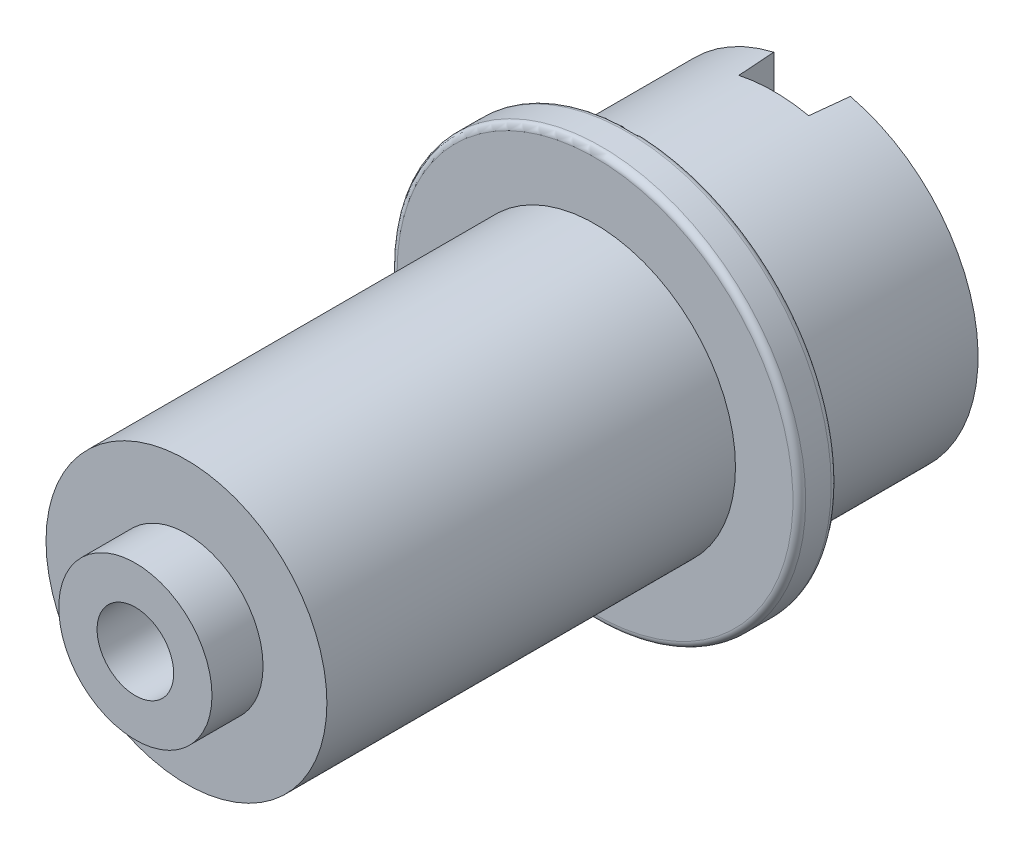
ISO-10303-21;
HEADER;
FILE_DESCRIPTION(('STEP AP214'),'2;1');
FILE_NAME('part.step','',(''),(''),'','','');
FILE_SCHEMA(('AUTOMOTIVE_DESIGN { 1 0 10303 214 1 1 1 1 }'));
ENDSEC;
DATA;
#1=APPLICATION_CONTEXT('core data for automotive mechanical design processes');
#2=APPLICATION_PROTOCOL_DEFINITION('international standard','automotive_design',2000,#1);
#3=PRODUCT_CONTEXT('',#1,'mechanical');
#4=PRODUCT('Part','Part','',(#3));
#5=PRODUCT_RELATED_PRODUCT_CATEGORY('part','',(#4));
#6=PRODUCT_DEFINITION_FORMATION('','',#4);
#7=PRODUCT_DEFINITION_CONTEXT('part definition',#1,'design');
#8=PRODUCT_DEFINITION('design','',#6,#7);
#9=PRODUCT_DEFINITION_SHAPE('','',#8);
#10=(LENGTH_UNIT() NAMED_UNIT(*) SI_UNIT(.MILLI.,.METRE.));
#11=(NAMED_UNIT(*) PLANE_ANGLE_UNIT() SI_UNIT($,.RADIAN.));
#12=(NAMED_UNIT(*) SI_UNIT($,.STERADIAN.) SOLID_ANGLE_UNIT());
#13=UNCERTAINTY_MEASURE_WITH_UNIT(LENGTH_MEASURE(1.E-05),#10,'distance_accuracy_value','');
#14=(GEOMETRIC_REPRESENTATION_CONTEXT(3) GLOBAL_UNCERTAINTY_ASSIGNED_CONTEXT((#13)) GLOBAL_UNIT_ASSIGNED_CONTEXT((#10,
#11,#12)) REPRESENTATION_CONTEXT('',''));
#15=CARTESIAN_POINT('',(0.,0.,0.));
#16=DIRECTION('',(0.,0.,1.));
#17=DIRECTION('',(1.,0.,0.));
#18=AXIS2_PLACEMENT_3D('',#15,#16,#17);
#19=CARTESIAN_POINT('',(0.,0.,-1.5));
#20=DIRECTION('',(0.,0.,-1.));
#21=DIRECTION('',(-1.,0.,0.));
#22=AXIS2_PLACEMENT_3D('',#19,#20,#21);
#23=PLANE('',#22);
#24=CARTESIAN_POINT('',(0.,0.,-1.5));
#25=DIRECTION('',(0.,0.,-1.));
#26=DIRECTION('',(-1.,0.,0.));
#27=AXIS2_PLACEMENT_3D('',#24,#25,#26);
#28=CIRCLE('',#27,7.75);
#29=CARTESIAN_POINT('',(-7.75,0.,-1.5));
#30=VERTEX_POINT('',#29);
#31=EDGE_CURVE('E280',#30,#30,#28,.T.);
#32=ORIENTED_EDGE('',*,*,#31,.T.);
#33=EDGE_LOOP('',(#32));
#34=FACE_BOUND('',#33,.T.);
#35=DIRECTION('',(0.,1.,0.));
#36=VECTOR('',#35,1.);
#37=CARTESIAN_POINT('',(3.,-7.,-1.50000000000001));
#38=LINE('',#37,#36);
#39=CARTESIAN_POINT('',(3.,-7.,-1.50000000000001));
#40=VERTEX_POINT('',#39);
#41=CARTESIAN_POINT('',(3.,-5.7662812973354,-1.50000000000001));
#42=VERTEX_POINT('',#41);
#43=EDGE_CURVE('E128',#40,#42,#38,.T.);
#44=ORIENTED_EDGE('',*,*,#43,.T.);
#45=CARTESIAN_POINT('',(0.,0.,-1.5));
#46=DIRECTION('',(0.,0.,-1.));
#47=DIRECTION('',(-1.,0.,0.));
#48=AXIS2_PLACEMENT_3D('',#45,#46,#47);
#49=CIRCLE('',#48,6.5);
#50=CARTESIAN_POINT('',(-3.,-5.7662812973354,-1.5));
#51=VERTEX_POINT('',#50);
#52=EDGE_CURVE('E154',#51,#42,#49,.T.);
#53=ORIENTED_EDGE('',*,*,#52,.F.);
#54=DIRECTION('',(0.,1.,0.));
#55=VECTOR('',#54,1.);
#56=CARTESIAN_POINT('',(-3.,-7.,-1.49999999999997));
#57=LINE('',#56,#55);
#58=CARTESIAN_POINT('',(-3.,-7.,-1.49999999999997));
#59=VERTEX_POINT('',#58);
#60=EDGE_CURVE('E46',#59,#51,#57,.T.);
#61=ORIENTED_EDGE('',*,*,#60,.F.);
#62=DIRECTION('',(1.,0.,0.));
#63=VECTOR('',#62,1.);
#64=CARTESIAN_POINT('',(-3.,-7.,-1.49999999999997));
#65=LINE('',#64,#63);
#66=EDGE_CURVE('E112',#59,#40,#65,.T.);
#67=ORIENTED_EDGE('',*,*,#66,.T.);
#68=EDGE_LOOP('',(#44,#53,#61,#67));
#69=FACE_BOUND('',#68,.T.);
#70=ADVANCED_FACE('F31',(#34,#69),#23,.T.);
#71=CARTESIAN_POINT('',(0.,0.,16.));
#72=DIRECTION('',(0.,0.,1.));
#73=DIRECTION('',(1.,0.,0.));
#74=AXIS2_PLACEMENT_3D('',#71,#72,#73);
#75=PLANE('',#74);
#76=CARTESIAN_POINT('',(0.,0.,16.));
#77=DIRECTION('',(0.,0.,1.));
#78=DIRECTION('',(1.,0.,0.));
#79=AXIS2_PLACEMENT_3D('',#76,#77,#78);
#80=CIRCLE('',#79,5.5);
#81=CARTESIAN_POINT('',(5.5,0.,16.));
#82=VERTEX_POINT('',#81);
#83=EDGE_CURVE('E169',#82,#82,#80,.T.);
#84=ORIENTED_EDGE('',*,*,#83,.T.);
#85=EDGE_LOOP('',(#84));
#86=FACE_BOUND('',#85,.T.);
#87=CARTESIAN_POINT('',(0.,0.,16.));
#88=DIRECTION('',(0.,0.,1.));
#89=DIRECTION('',(1.,0.,0.));
#90=AXIS2_PLACEMENT_3D('',#87,#88,#89);
#91=CIRCLE('',#90,3.);
#92=CARTESIAN_POINT('',(3.,0.,16.));
#93=VERTEX_POINT('',#92);
#94=EDGE_CURVE('E163',#93,#93,#91,.T.);
#95=ORIENTED_EDGE('',*,*,#94,.F.);
#96=EDGE_LOOP('',(#95));
#97=FACE_BOUND('',#96,.T.);
#98=ADVANCED_FACE('F229',(#86,#97),#75,.T.);
#99=CARTESIAN_POINT('',(0.,0.,16.));
#100=DIRECTION('',(0.,0.,-1.));
#101=DIRECTION('',(-1.,0.,0.));
#102=AXIS2_PLACEMENT_3D('',#99,#100,#101);
#103=CYLINDRICAL_SURFACE('',#102,5.5);
#104=ORIENTED_EDGE('',*,*,#83,.F.);
#105=EDGE_LOOP('',(#104));
#106=FACE_BOUND('',#105,.T.);
#107=CARTESIAN_POINT('',(0.,0.,0.));
#108=DIRECTION('',(0.,0.,-1.));
#109=DIRECTION('',(-1.,0.,0.));
#110=AXIS2_PLACEMENT_3D('',#107,#108,#109);
#111=CIRCLE('',#110,5.5);
#112=CARTESIAN_POINT('',(-5.5,0.,0.));
#113=VERTEX_POINT('',#112);
#114=EDGE_CURVE('E160',#113,#113,#111,.T.);
#115=ORIENTED_EDGE('',*,*,#114,.F.);
#116=EDGE_LOOP('',(#115));
#117=FACE_BOUND('',#116,.T.);
#118=ADVANCED_FACE('F33',(#106,#117),#103,.T.);
#119=CARTESIAN_POINT('',(0.,0.,18.));
#120=DIRECTION('',(0.,0.,-1.));
#121=DIRECTION('',(-1.,0.,0.));
#122=AXIS2_PLACEMENT_3D('',#119,#120,#121);
#123=CYLINDRICAL_SURFACE('',#122,3.);
#124=CARTESIAN_POINT('',(0.,0.,18.));
#125=DIRECTION('',(0.,0.,1.));
#126=DIRECTION('',(1.,0.,0.));
#127=AXIS2_PLACEMENT_3D('',#124,#125,#126);
#128=CIRCLE('',#127,3.);
#129=CARTESIAN_POINT('',(3.,0.,18.));
#130=VERTEX_POINT('',#129);
#131=EDGE_CURVE('E166',#130,#130,#128,.T.);
#132=ORIENTED_EDGE('',*,*,#131,.F.);
#133=EDGE_LOOP('',(#132));
#134=FACE_BOUND('',#133,.T.);
#135=ORIENTED_EDGE('',*,*,#94,.T.);
#136=EDGE_LOOP('',(#135));
#137=FACE_BOUND('',#136,.T.);
#138=ADVANCED_FACE('F246',(#134,#137),#123,.T.);
#139=CARTESIAN_POINT('',(0.,0.,18.));
#140=DIRECTION('',(0.,0.,1.));
#141=DIRECTION('',(1.,0.,0.));
#142=AXIS2_PLACEMENT_3D('',#139,#140,#141);
#143=PLANE('',#142);
#144=CARTESIAN_POINT('',(0.,0.,18.));
#145=DIRECTION('',(0.,0.,1.));
#146=DIRECTION('',(1.,0.,0.));
#147=AXIS2_PLACEMENT_3D('',#144,#145,#146);
#148=CIRCLE('',#147,1.5);
#149=CARTESIAN_POINT('',(1.5,0.,18.));
#150=VERTEX_POINT('',#149);
#151=EDGE_CURVE('E286',#150,#150,#148,.T.);
#152=ORIENTED_EDGE('',*,*,#151,.F.);
#153=EDGE_LOOP('',(#152));
#154=FACE_BOUND('',#153,.T.);
#155=ORIENTED_EDGE('',*,*,#131,.T.);
#156=EDGE_LOOP('',(#155));
#157=FACE_BOUND('',#156,.T.);
#158=ADVANCED_FACE('F243',(#154,#157),#143,.T.);
#159=CARTESIAN_POINT('',(0.,0.,0.));
#160=DIRECTION('',(0.,0.,-1.));
#161=DIRECTION('',(-1.,0.,0.));
#162=AXIS2_PLACEMENT_3D('',#159,#160,#161);
#163=PLANE('',#162);
#164=CARTESIAN_POINT('',(0.,0.,0.));
#165=DIRECTION('',(0.,0.,-1.));
#166=DIRECTION('',(-1.,0.,0.));
#167=AXIS2_PLACEMENT_3D('',#164,#165,#166);
#168=CIRCLE('',#167,7.75);
#169=CARTESIAN_POINT('',(-7.75,0.,0.));
#170=VERTEX_POINT('',#169);
#171=EDGE_CURVE('E11',#170,#170,#168,.F.);
#172=ORIENTED_EDGE('',*,*,#171,.T.);
#173=EDGE_LOOP('',(#172));
#174=FACE_BOUND('',#173,.T.);
#175=ORIENTED_EDGE('',*,*,#114,.T.);
#176=EDGE_LOOP('',(#175));
#177=FACE_BOUND('',#176,.T.);
#178=ADVANCED_FACE('F239',(#174,#177),#163,.F.);
#179=CARTESIAN_POINT('',(0.,0.,-1.5));
#180=DIRECTION('',(0.,0.,1.));
#181=DIRECTION('',(1.,0.,0.));
#182=AXIS2_PLACEMENT_3D('',#179,#180,#181);
#183=CYLINDRICAL_SURFACE('',#182,8.);
#184=CARTESIAN_POINT('',(0.,0.,-1.25));
#185=DIRECTION('',(0.,0.,-1.));
#186=DIRECTION('',(-1.,0.,0.));
#187=AXIS2_PLACEMENT_3D('',#184,#185,#186);
#188=CIRCLE('',#187,8.);
#189=CARTESIAN_POINT('',(-8.,0.,-1.25));
#190=VERTEX_POINT('',#189);
#191=EDGE_CURVE('E39',#190,#190,#188,.F.);
#192=ORIENTED_EDGE('',*,*,#191,.T.);
#193=EDGE_LOOP('',(#192));
#194=FACE_BOUND('',#193,.T.);
#195=CARTESIAN_POINT('',(0.,0.,-0.25));
#196=DIRECTION('',(0.,0.,-1.));
#197=DIRECTION('',(-1.,0.,0.));
#198=AXIS2_PLACEMENT_3D('',#195,#196,#197);
#199=CIRCLE('',#198,8.);
#200=CARTESIAN_POINT('',(-8.,0.,-0.25));
#201=VERTEX_POINT('',#200);
#202=EDGE_CURVE('E278',#201,#201,#199,.T.);
#203=ORIENTED_EDGE('',*,*,#202,.T.);
#204=EDGE_LOOP('',(#203));
#205=FACE_BOUND('',#204,.T.);
#206=ADVANCED_FACE('F225',(#194,#205),#183,.T.);
#207=CARTESIAN_POINT('',(0.,0.,-8.5));
#208=DIRECTION('',(0.,0.,1.));
#209=DIRECTION('',(1.,0.,0.));
#210=AXIS2_PLACEMENT_3D('',#207,#208,#209);
#211=CYLINDRICAL_SURFACE('',#210,6.5);
#212=CARTESIAN_POINT('',(0.,0.,-7.));
#213=DIRECTION('',(0.,0.,1.));
#214=DIRECTION('',(1.,0.,0.));
#215=AXIS2_PLACEMENT_3D('',#212,#213,#214);
#216=CIRCLE('',#215,6.5);
#217=CARTESIAN_POINT('',(1.36876700471111,6.35424872717571,-7.));
#218=VERTEX_POINT('',#217);
#219=CARTESIAN_POINT('',(-1.36876700471111,6.35424872717571,-7.));
#220=VERTEX_POINT('',#219);
#221=EDGE_CURVE('E138',#218,#220,#216,.T.);
#222=ORIENTED_EDGE('',*,*,#221,.T.);
#223=CARTESIAN_POINT('',(0.,0.,8.64507845414196));
#224=DIRECTION('',(-0.996194698091746,0.,0.0871557427476584));
#225=DIRECTION('',(0.0871557427476584,0.,0.996194698091746));
#226=AXIS2_PLACEMENT_3D('',#223,#224,#225);
#227=ELLIPSE('',#226,74.5791360968539,6.5);
#228=CARTESIAN_POINT('',(-1.5,6.32455532033676,-8.5));
#229=VERTEX_POINT('',#228);
#230=EDGE_CURVE('E145',#220,#229,#227,.T.);
#231=ORIENTED_EDGE('',*,*,#230,.T.);
#232=CARTESIAN_POINT('',(0.,0.,-8.5));
#233=DIRECTION('',(0.,0.,-1.));
#234=DIRECTION('',(-1.,0.,0.));
#235=AXIS2_PLACEMENT_3D('',#232,#233,#234);
#236=CIRCLE('',#235,6.5);
#237=CARTESIAN_POINT('',(1.5,6.32455532033676,-8.5));
#238=VERTEX_POINT('',#237);
#239=EDGE_CURVE('E157',#238,#229,#236,.T.);
#240=ORIENTED_EDGE('',*,*,#239,.F.);
#241=CARTESIAN_POINT('',(0.,0.,8.64507845414196));
#242=DIRECTION('',(0.996194698091746,0.,0.0871557427476584));
#243=DIRECTION('',(-0.0871557427476584,0.,0.996194698091746));
#244=AXIS2_PLACEMENT_3D('',#241,#242,#243);
#245=ELLIPSE('',#244,74.5791360968539,6.5);
#246=EDGE_CURVE('E142',#238,#218,#245,.T.);
#247=ORIENTED_EDGE('',*,*,#246,.T.);
#248=EDGE_LOOP('',(#222,#231,#240,#247));
#249=FACE_BOUND('',#248,.T.);
#250=ORIENTED_EDGE('',*,*,#52,.T.);
#251=DIRECTION('',(0.,0.,1.));
#252=VECTOR('',#251,1.);
#253=CARTESIAN_POINT('',(3.,-5.7662812973354,-8.5));
#254=LINE('',#253,#252);
#255=CARTESIAN_POINT('',(3.,-5.7662812973354,-5.));
#256=VERTEX_POINT('',#255);
#257=EDGE_CURVE('E189',#42,#256,#254,.F.);
#258=ORIENTED_EDGE('',*,*,#257,.T.);
#259=CARTESIAN_POINT('',(3.,-5.7662812973354,-5.));
#260=CARTESIAN_POINT('',(3.00001325486749,-5.76626092125269,-5.07945393159843));
#261=CARTESIAN_POINT('',(2.9968439571685,-5.76792298613654,-5.15889667416636));
#262=CARTESIAN_POINT('',(2.98424426186683,-5.77445907624308,-5.31711145525811));
#263=CARTESIAN_POINT('',(2.97481707717535,-5.77933145322453,-5.39588381695874));
#264=CARTESIAN_POINT('',(2.94986780093595,-5.79210360094206,-5.55180242470729));
#265=CARTESIAN_POINT('',(2.93437634706702,-5.79998814895088,-5.62895482218778));
#266=CARTESIAN_POINT('',(2.89749007538821,-5.81850289077183,-5.78148270996379));
#267=CARTESIAN_POINT('',(2.8760947185088,-5.82913333529874,-5.85685803731731));
#268=CARTESIAN_POINT('',(2.80344872672043,-5.86460568069906,-6.07932099731613));
#269=CARTESIAN_POINT('',(2.7436725380155,-5.89306438821246,-6.22314808725836));
#270=CARTESIAN_POINT('',(2.60337128590596,-5.95637113726352,-6.49882225419634));
#271=CARTESIAN_POINT('',(2.52281912744835,-5.99122750508405,-6.63065338058671));
#272=CARTESIAN_POINT('',(2.33672447658037,-6.06633769718149,-6.88857183246516));
#273=CARTESIAN_POINT('',(2.22983981013203,-6.10679805162524,-7.01363285633832));
#274=CARTESIAN_POINT('',(1.99693926734487,-6.18687262182293,-7.24481036127222));
#275=CARTESIAN_POINT('',(1.87091876760921,-6.22648663044616,-7.35092225052552));
#276=CARTESIAN_POINT('',(1.59474472210823,-6.30304778899414,-7.54696071087403));
#277=CARTESIAN_POINT('',(1.44364024712299,-6.33972510221638,-7.63566291765493));
#278=CARTESIAN_POINT('',(1.12664825760663,-6.40365031730568,-7.78592513838278));
#279=CARTESIAN_POINT('',(0.960768773700223,-6.43090330269763,-7.84749978998225));
#280=CARTESIAN_POINT('',(0.629868706698132,-6.47142154982129,-7.93782592174846));
#281=CARTESIAN_POINT('',(0.465435750010198,-6.48545102930012,-7.96837987550274));
#282=CARTESIAN_POINT('',(0.133218337060345,-6.50075755264512,-8.0016798660061));
#283=CARTESIAN_POINT('',(-0.0345644432411095,-6.50204082096515,-8.00443947578696));
#284=CARTESIAN_POINT('',(-0.3553847170163,-6.49211498981173,-7.98288790851684));
#285=CARTESIAN_POINT('',(-0.508590859602237,-6.4818278122866,-7.96057464080085));
#286=CARTESIAN_POINT('',(-0.808793598665934,-6.45124986441835,-7.89301384747723));
#287=CARTESIAN_POINT('',(-0.955789851467938,-6.43095854119823,-7.84776505433874));
#288=CARTESIAN_POINT('',(-1.2421119656785,-6.38189566611913,-7.7351762171615));
#289=CARTESIAN_POINT('',(-1.38128946935679,-6.35300132804897,-7.66751459462998));
#290=CARTESIAN_POINT('',(-1.64667796870997,-6.28944357871966,-7.5123901547607));
#291=CARTESIAN_POINT('',(-1.77288397909838,-6.25477796271627,-7.4249197654573));
#292=CARTESIAN_POINT('',(-2.01997062915893,-6.17962435860474,-7.22421081011658));
#293=CARTESIAN_POINT('',(-2.13952681604742,-6.1388918999639,-7.10943053249346));
#294=CARTESIAN_POINT('',(-2.35835109760829,-6.05820178290307,-6.86160136547798));
#295=CARTESIAN_POINT('',(-2.45760519646737,-6.01824467605489,-6.72853997842289));
#296=CARTESIAN_POINT('',(-2.63764698098138,-5.94162278727149,-6.43981323195344));
#297=CARTESIAN_POINT('',(-2.71730972441238,-5.9052106138375,-6.28336600935372));
#298=CARTESIAN_POINT('',(-2.81569663066613,-5.85859720027945,-6.0390280319213));
#299=CARTESIAN_POINT('',(-2.84496710352513,-5.84439750991949,-5.95600505573651));
#300=CARTESIAN_POINT('',(-2.8961975756877,-5.81917947714126,-5.78727579755948));
#301=CARTESIAN_POINT('',(-2.91816079680302,-5.80815973295046,-5.70157071640827));
#302=CARTESIAN_POINT('',(-2.95738281240241,-5.78830560214407,-5.51423534552411));
#303=CARTESIAN_POINT('',(-2.97332046079695,-5.78010598651373,-5.41225714731425));
#304=CARTESIAN_POINT('',(-2.99465167662971,-5.76906317974113,-5.20686210264438));
#305=CARTESIAN_POINT('',(-3.00003902923056,-5.76622314579055,-5.10344444434316));
#306=CARTESIAN_POINT('',(-3.,-5.7662812973354,-5.));
#307=B_SPLINE_CURVE_WITH_KNOTS('',3,(#259,#260,#261,#262,#263,#264,#265,#266,#267,#268,#269,
#270,#271,#272,#273,#274,#275,#276,#277,#278,#279,#280,#281,#282,#283,#284,#285,#286,#287,#288,
#289,#290,#291,#292,#293,#294,#295,#296,#297,#298,#299,#300,#301,#302,#303,#304,#305,#306),
.UNSPECIFIED.,.F.,.F.,(4,2,2,2,2,2,2,2,2,2,2,2,2,2,2,2,2,2,2,2,2,2,2,4),(0.,0.23826278553123,
0.476403337198864,0.713355977077896,0.950330259629165,1.42306618576011,1.89642177724908,
2.40248498359661,2.90867065468407,3.44293565486749,3.97691201893037,4.47769426022451,
4.97823193870282,5.44154616888585,5.90488600690272,6.37518467403007,6.84566341871178,
7.35542436700875,7.86553555764459,8.40031176228758,8.66749187492018,8.93455402961881,
9.24448664723275,9.55460178125648),.UNSPECIFIED.);
#308=CARTESIAN_POINT('',(-3.,-5.7662812973354,-5.));
#309=VERTEX_POINT('',#308);
#310=EDGE_CURVE('E182',#256,#309,#307,.T.);
#311=ORIENTED_EDGE('',*,*,#310,.T.);
#312=DIRECTION('',(0.,0.,1.));
#313=VECTOR('',#312,1.);
#314=CARTESIAN_POINT('',(-3.,-5.7662812973354,-8.5));
#315=LINE('',#314,#313);
#316=EDGE_CURVE('E99',#309,#51,#315,.T.);
#317=ORIENTED_EDGE('',*,*,#316,.T.);
#318=EDGE_LOOP('',(#250,#258,#311,#317));
#319=FACE_BOUND('',#318,.T.);
#320=ADVANCED_FACE('F191',(#249,#319),#211,.T.);
#321=CARTESIAN_POINT('',(0.,0.,-8.5));
#322=DIRECTION('',(0.,0.,-1.));
#323=DIRECTION('',(-1.,0.,0.));
#324=AXIS2_PLACEMENT_3D('',#321,#322,#323);
#325=PLANE('',#324);
#326=DIRECTION('',(0.,1.,0.));
#327=VECTOR('',#326,1.);
#328=CARTESIAN_POINT('',(-1.5,7.,-8.5));
#329=LINE('',#328,#327);
#330=CARTESIAN_POINT('',(-1.5,4.24264068711928,-8.5));
#331=VERTEX_POINT('',#330);
#332=EDGE_CURVE('E133',#331,#229,#329,.T.);
#333=ORIENTED_EDGE('',*,*,#332,.F.);
#334=CARTESIAN_POINT('',(0.,0.,-8.5));
#335=DIRECTION('',(0.,0.,-1.));
#336=DIRECTION('',(-1.,0.,0.));
#337=AXIS2_PLACEMENT_3D('',#334,#335,#336);
#338=CIRCLE('',#337,4.5);
#339=CARTESIAN_POINT('',(1.5,4.24264068711928,-8.5));
#340=VERTEX_POINT('',#339);
#341=EDGE_CURVE('E148',#340,#331,#338,.T.);
#342=ORIENTED_EDGE('',*,*,#341,.F.);
#343=DIRECTION('',(0.,-1.,0.));
#344=VECTOR('',#343,1.);
#345=CARTESIAN_POINT('',(1.5,7.,-8.5));
#346=LINE('',#345,#344);
#347=EDGE_CURVE('E127',#238,#340,#346,.T.);
#348=ORIENTED_EDGE('',*,*,#347,.F.);
#349=ORIENTED_EDGE('',*,*,#239,.T.);
#350=EDGE_LOOP('',(#333,#342,#348,#349));
#351=FACE_BOUND('',#350,.T.);
#352=ADVANCED_FACE('F218',(#351),#325,.T.);
#353=CARTESIAN_POINT('',(0.,0.,10.5));
#354=DIRECTION('',(0.,0.,-1.));
#355=DIRECTION('',(-1.,0.,0.));
#356=AXIS2_PLACEMENT_3D('',#353,#354,#355);
#357=CYLINDRICAL_SURFACE('',#356,4.5);
#358=CARTESIAN_POINT('',(0.,-4.5,-6.5));
#359=CARTESIAN_POINT('',(-0.0818450443300857,-4.50000022951416,-6.50000038059746));
#360=CARTESIAN_POINT('',(-0.163687791807826,-4.49774654261317,-6.49327960080918));
#361=CARTESIAN_POINT('',(-0.324962641309459,-4.48897815304921,-6.46665633677417));
#362=CARTESIAN_POINT('',(-0.404394492178227,-4.48246300803229,-6.44675248407662));
#363=CARTESIAN_POINT('',(-0.558499184252665,-4.46587961859664,-6.39452113492393));
#364=CARTESIAN_POINT('',(-0.633179738829052,-4.4558173159628,-6.36221440631109));
#365=CARTESIAN_POINT('',(-0.776062405207988,-4.43316668576013,-6.28618824074248));
#366=CARTESIAN_POINT('',(-0.844263235438059,-4.42057786001667,-6.2424665524961));
#367=CARTESIAN_POINT('',(-0.9746125125334,-4.39371141664507,-6.14326129271187));
#368=CARTESIAN_POINT('',(-1.03650555044746,-4.37939334695677,-6.08745314860926));
#369=CARTESIAN_POINT('',(-1.15024903905313,-4.35090472174682,-5.96634926794015));
#370=CARTESIAN_POINT('',(-1.20209727823419,-4.33673419935823,-5.90105144760723));
#371=CARTESIAN_POINT('',(-1.29573741334179,-4.30969998715911,-5.76052232720531));
#372=CARTESIAN_POINT('',(-1.33719728733155,-4.29688558913532,-5.68505939040182));
#373=CARTESIAN_POINT('',(-1.40672831081658,-4.27462958127902,-5.52773585831218));
#374=CARTESIAN_POINT('',(-1.43480354608015,-4.26518694241118,-5.44587722425589));
#375=CARTESIAN_POINT('',(-1.47581019226375,-4.25116954904066,-5.28099016775494));
#376=CARTESIAN_POINT('',(-1.48922017240766,-4.24644143654417,-5.19809418726641));
#377=CARTESIAN_POINT('',(-1.50201168500172,-4.24193484944261,-5.03110436876618));
#378=CARTESIAN_POINT('',(-1.50139755240708,-4.24215484534095,-4.94701090893622));
#379=CARTESIAN_POINT('',(-1.48652985555513,-4.2473852251227,-4.78409505433397));
#380=CARTESIAN_POINT('',(-1.47290086975049,-4.25217623801299,-4.70520739562147));
#381=CARTESIAN_POINT('',(-1.43340924427413,-4.26564986586826,-4.55090987058975));
#382=CARTESIAN_POINT('',(-1.40754513988781,-4.27433294676161,-4.4755004218474));
#383=CARTESIAN_POINT('',(-1.34390858709032,-4.29476866696873,-4.32888087561278));
#384=CARTESIAN_POINT('',(-1.30595107306089,-4.30656848689676,-4.25775796179571));
#385=CARTESIAN_POINT('',(-1.21933365945471,-4.33188837863589,-4.12269363758041));
#386=CARTESIAN_POINT('',(-1.17067066854601,-4.34540894685695,-4.05875430959993));
#387=CARTESIAN_POINT('',(-1.06102399902336,-4.37350993751611,-3.93636260275884));
#388=CARTESIAN_POINT('',(-0.999529725114468,-4.38810884032264,-3.8783709582364));
#389=CARTESIAN_POINT('',(-0.867509354955097,-4.41610407580555,-3.7734031000049));
#390=CARTESIAN_POINT('',(-0.796982393491223,-4.42950029307101,-3.72642794275326));
#391=CARTESIAN_POINT('',(-0.647921419569402,-4.4537566190669,-3.6444555496474));
#392=CARTESIAN_POINT('',(-0.569314914624506,-4.46459025012059,-3.6095817629889));
#393=CARTESIAN_POINT('',(-0.406903625046762,-4.48230850716652,-3.55369523906643));
#394=CARTESIAN_POINT('',(-0.323100657232431,-4.48919450482319,-3.53267768686484));
#395=CARTESIAN_POINT('',(-0.156575744293957,-4.49801440607161,-3.50591650096646));
#396=CARTESIAN_POINT('',(-0.0739643997972705,-4.50015002750592,-3.49955028624087));
#397=CARTESIAN_POINT('',(0.0911626049403549,-4.49983354042241,-3.5004990103977));
#398=CARTESIAN_POINT('',(0.173678278979475,-4.49738220629043,-3.50781163996982));
#399=CARTESIAN_POINT('',(0.333779799456382,-4.48830037075656,-3.53541786160394));
#400=CARTESIAN_POINT('',(0.411439210252264,-4.48179298066788,-3.55532930907424));
#401=CARTESIAN_POINT('',(0.562283937869359,-4.46537770245105,-3.60709016670009));
#402=CARTESIAN_POINT('',(0.635468682762909,-4.45546938070013,-3.63894109920168));
#403=CARTESIAN_POINT('',(0.777432444589909,-4.43293396930935,-3.71460564776118));
#404=CARTESIAN_POINT('',(0.84604493882572,-4.42024222133679,-3.75871188992476));
#405=CARTESIAN_POINT('',(0.975097245203379,-4.39357880874394,-3.85729122502023));
#406=CARTESIAN_POINT('',(1.03553455169336,-4.37960675390741,-3.91176748404765));
#407=CARTESIAN_POINT('',(1.14937876170945,-4.35115271970667,-4.03246812650988));
#408=CARTESIAN_POINT('',(1.20234145386866,-4.33667641631142,-4.09911384039029));
#409=CARTESIAN_POINT('',(1.29638628348536,-4.30949959942063,-4.24065735171633));
#410=CARTESIAN_POINT('',(1.33746832189652,-4.29679910073003,-4.31555521795111));
#411=CARTESIAN_POINT('',(1.40639539562454,-4.27473587687075,-4.47150952293484));
#412=CARTESIAN_POINT('',(1.43426719824753,-4.26536641189468,-4.55255311875315));
#413=CARTESIAN_POINT('',(1.47584200013903,-4.25116248459674,-4.7185679750662));
#414=CARTESIAN_POINT('',(1.48955138243091,-4.24632597935459,-4.80353744810652));
#415=CARTESIAN_POINT('',(1.50191442371601,-4.24196788311266,-4.97029564406138));
#416=CARTESIAN_POINT('',(1.5013053859626,-4.24218600386123,-5.05202351043024));
#417=CARTESIAN_POINT('',(1.48686344017304,-4.24726904735801,-5.21414761238309));
#418=CARTESIAN_POINT('',(1.47303131918788,-4.25213369354042,-5.29454392693263));
#419=CARTESIAN_POINT('',(1.43305771969402,-4.26576786457337,-5.45020349450371));
#420=CARTESIAN_POINT('',(1.40715501902327,-4.27446147033716,-5.52553523750674));
#421=CARTESIAN_POINT('',(1.34396904863962,-4.29474598227703,-5.6708411104074));
#422=CARTESIAN_POINT('',(1.30668325283071,-4.3063375314509,-5.74081404678201));
#423=CARTESIAN_POINT('',(1.21989103887514,-4.33174243839069,-5.87672550488437));
#424=CARTESIAN_POINT('',(1.16992236414687,-4.34563067463205,-5.94235475284758));
#425=CARTESIAN_POINT('',(1.05996432470347,-4.37375034424879,-6.0645347200763));
#426=CARTESIAN_POINT('',(0.999972126677222,-4.38798187368558,-6.12108286353211));
#427=CARTESIAN_POINT('',(0.868862335381032,-4.41585045788316,-6.22571661843377));
#428=CARTESIAN_POINT('',(0.797402270249593,-4.42944272701885,-6.2733865216265));
#429=CARTESIAN_POINT('',(0.647036036109937,-4.45388986758918,-6.35598564327597));
#430=CARTESIAN_POINT('',(0.568131777198522,-4.46474543861895,-6.39091811888306));
#431=CARTESIAN_POINT('',(0.408740470801463,-4.48208272602813,-6.44558244873301));
#432=CARTESIAN_POINT('',(0.328481636514612,-4.48873818633784,-6.46592369939507));
#433=CARTESIAN_POINT('',(0.165480624015369,-4.49769610596333,-6.49313042101569));
#434=CARTESIAN_POINT('',(0.0827391383531185,-4.49999976797857,-6.49999961524481));
#435=CARTESIAN_POINT('',(0.,-4.5,-6.5));
#436=B_SPLINE_CURVE_WITH_KNOTS('',3,(#358,#359,#360,#361,#362,#363,#364,#365,#366,#367,#368,
#369,#370,#371,#372,#373,#374,#375,#376,#377,#378,#379,#380,#381,#382,#383,#384,#385,#386,#387,
#388,#389,#390,#391,#392,#393,#394,#395,#396,#397,#398,#399,#400,#401,#402,#403,#404,#405,#406,
#407,#408,#409,#410,#411,#412,#413,#414,#415,#416,#417,#418,#419,#420,#421,#422,#423,#424,#425,
#426,#427,#428,#429,#430,#431,#432,#433,#434,#435),.UNSPECIFIED.,.T.,.F.,(4,2,2,2,2,2,2,2,2,2,2,
2,2,2,2,2,2,2,2,2,2,2,2,2,2,2,2,2,2,2,2,2,2,2,2,2,2,2,4),(0.,0.245230659039016,
0.490486777901281,0.735334009305411,0.980229566698651,1.23277026424134,1.48536649931295,
1.74522577235206,2.0050056703925,2.2560288861276,2.50697450981228,2.7464523982692,
2.98595896283223,3.22932256732696,3.47275653837311,3.7288995871705,3.98506718949927,
4.24377608475536,4.50239503315813,4.74980374762754,4.99717069746265,5.2373723696732,
5.47760467926156,5.72415599765605,5.97078271232837,6.22861534321128,6.48645012352495,
6.74376020740156,7.0009542705876,7.24493499096387,7.48890119027063,7.72823380620626,
7.96761957263966,8.21745100037707,8.46735316685668,8.72699491252651,8.98657021728684,
9.23454837560721,9.4824579905721),.UNSPECIFIED.);
#437=CARTESIAN_POINT('',(0.,-4.5,-6.5));
#438=VERTEX_POINT('',#437);
#439=EDGE_CURVE('E120',#438,#438,#436,.T.);
#440=ORIENTED_EDGE('',*,*,#439,.F.);
#441=EDGE_LOOP('',(#440));
#442=FACE_BOUND('',#441,.T.);
#443=ORIENTED_EDGE('',*,*,#341,.T.);
#444=CARTESIAN_POINT('',(0.,0.,8.64507845414196));
#445=DIRECTION('',(-0.996194698091746,0.,0.0871557427476584));
#446=DIRECTION('',(-0.0871557427476584,0.,-0.996194698091746));
#447=AXIS2_PLACEMENT_3D('',#444,#445,#446);
#448=ELLIPSE('',#447,51.6317096055142,4.5);
#449=CARTESIAN_POINT('',(-1.36876700471111,4.28677931398552,-7.));
#450=VERTEX_POINT('',#449);
#451=EDGE_CURVE('E178',#331,#450,#448,.F.);
#452=ORIENTED_EDGE('',*,*,#451,.T.);
#453=CARTESIAN_POINT('',(0.,0.,-7.));
#454=DIRECTION('',(0.,0.,1.));
#455=DIRECTION('',(1.,0.,0.));
#456=AXIS2_PLACEMENT_3D('',#453,#454,#455);
#457=CIRCLE('',#456,4.5);
#458=CARTESIAN_POINT('',(1.36876700471111,4.28677931398552,-7.));
#459=VERTEX_POINT('',#458);
#460=EDGE_CURVE('E172',#450,#459,#457,.F.);
#461=ORIENTED_EDGE('',*,*,#460,.T.);
#462=CARTESIAN_POINT('',(0.,0.,8.64507845414196));
#463=DIRECTION('',(0.996194698091746,0.,0.0871557427476584));
#464=DIRECTION('',(0.0871557427476584,0.,-0.996194698091746));
#465=AXIS2_PLACEMENT_3D('',#462,#463,#464);
#466=ELLIPSE('',#465,51.6317096055142,4.5);
#467=EDGE_CURVE('E175',#459,#340,#466,.F.);
#468=ORIENTED_EDGE('',*,*,#467,.T.);
#469=EDGE_LOOP('',(#443,#452,#461,#468));
#470=FACE_BOUND('',#469,.T.);
#471=CARTESIAN_POINT('',(0.,0.,10.5));
#472=DIRECTION('',(0.,0.,-1.));
#473=DIRECTION('',(-1.,0.,0.));
#474=AXIS2_PLACEMENT_3D('',#471,#472,#473);
#475=CIRCLE('',#474,4.5);
#476=CARTESIAN_POINT('',(-4.5,0.,10.5));
#477=VERTEX_POINT('',#476);
#478=EDGE_CURVE('E151',#477,#477,#475,.T.);
#479=ORIENTED_EDGE('',*,*,#478,.F.);
#480=EDGE_LOOP('',(#479));
#481=FACE_BOUND('',#480,.T.);
#482=ADVANCED_FACE('F215',(#442,#470,#481),#357,.F.);
#483=CARTESIAN_POINT('',(0.,0.,10.5));
#484=DIRECTION('',(0.,0.,-1.));
#485=DIRECTION('',(-1.,0.,0.));
#486=AXIS2_PLACEMENT_3D('',#483,#484,#485);
#487=PLANE('',#486);
#488=CARTESIAN_POINT('',(0.,0.,10.5));
#489=DIRECTION('',(0.,0.,-1.));
#490=DIRECTION('',(-1.,0.,0.));
#491=AXIS2_PLACEMENT_3D('',#488,#489,#490);
#492=CIRCLE('',#491,1.5);
#493=CARTESIAN_POINT('',(-1.5,0.,10.5));
#494=VERTEX_POINT('',#493);
#495=EDGE_CURVE('E284',#494,#494,#492,.T.);
#496=ORIENTED_EDGE('',*,*,#495,.F.);
#497=EDGE_LOOP('',(#496));
#498=FACE_BOUND('',#497,.T.);
#499=ORIENTED_EDGE('',*,*,#478,.T.);
#500=EDGE_LOOP('',(#499));
#501=FACE_BOUND('',#500,.T.);
#502=ADVANCED_FACE('F211',(#498,#501),#487,.T.);
#503=CARTESIAN_POINT('',(-1.5,7.,-8.5));
#504=DIRECTION('',(-0.996194698091746,0.,0.0871557427476584));
#505=DIRECTION('',(0.0871557427476584,0.,0.996194698091746));
#506=AXIS2_PLACEMENT_3D('',#503,#504,#505);
#507=PLANE('',#506);
#508=DIRECTION('',(0.,1.,0.));
#509=VECTOR('',#508,1.);
#510=CARTESIAN_POINT('',(-1.36876700471111,7.,-7.));
#511=LINE('',#510,#509);
#512=EDGE_CURVE('E135',#450,#220,#511,.T.);
#513=ORIENTED_EDGE('',*,*,#512,.F.);
#514=ORIENTED_EDGE('',*,*,#451,.F.);
#515=ORIENTED_EDGE('',*,*,#332,.T.);
#516=ORIENTED_EDGE('',*,*,#230,.F.);
#517=EDGE_LOOP('',(#513,#514,#515,#516));
#518=FACE_BOUND('',#517,.T.);
#519=ADVANCED_FACE('F207',(#518),#507,.F.);
#520=CARTESIAN_POINT('',(1.5,7.,-8.5));
#521=DIRECTION('',(0.996194698091746,0.,0.0871557427476584));
#522=DIRECTION('',(0.0871557427476584,0.,-0.996194698091746));
#523=AXIS2_PLACEMENT_3D('',#520,#521,#522);
#524=PLANE('',#523);
#525=ORIENTED_EDGE('',*,*,#347,.T.);
#526=ORIENTED_EDGE('',*,*,#467,.F.);
#527=DIRECTION('',(0.,-1.,0.));
#528=VECTOR('',#527,1.);
#529=CARTESIAN_POINT('',(1.36876700471111,7.,-7.));
#530=LINE('',#529,#528);
#531=EDGE_CURVE('E54',#218,#459,#530,.T.);
#532=ORIENTED_EDGE('',*,*,#531,.F.);
#533=ORIENTED_EDGE('',*,*,#246,.F.);
#534=EDGE_LOOP('',(#525,#526,#532,#533));
#535=FACE_BOUND('',#534,.T.);
#536=ADVANCED_FACE('F204',(#535),#524,.F.);
#537=CARTESIAN_POINT('',(-1.5,7.,-7.));
#538=DIRECTION('',(0.,0.,1.));
#539=DIRECTION('',(1.,0.,0.));
#540=AXIS2_PLACEMENT_3D('',#537,#538,#539);
#541=PLANE('',#540);
#542=ORIENTED_EDGE('',*,*,#531,.T.);
#543=ORIENTED_EDGE('',*,*,#460,.F.);
#544=ORIENTED_EDGE('',*,*,#512,.T.);
#545=ORIENTED_EDGE('',*,*,#221,.F.);
#546=EDGE_LOOP('',(#542,#543,#544,#545));
#547=FACE_BOUND('',#546,.T.);
#548=ADVANCED_FACE('F200',(#547),#541,.F.);
#549=CARTESIAN_POINT('',(0.,-7.,-5.));
#550=DIRECTION('',(0.,1.,0.));
#551=DIRECTION('',(0.,0.,1.));
#552=AXIS2_PLACEMENT_3D('',#549,#550,#551);
#553=CYLINDRICAL_SURFACE('',#552,3.);
#554=ORIENTED_EDGE('',*,*,#310,.F.);
#555=DIRECTION('',(0.,1.,0.));
#556=VECTOR('',#555,1.);
#557=CARTESIAN_POINT('',(3.,-7.,-5.));
#558=LINE('',#557,#556);
#559=CARTESIAN_POINT('',(3.,-7.,-5.));
#560=VERTEX_POINT('',#559);
#561=EDGE_CURVE('E116',#560,#256,#558,.T.);
#562=ORIENTED_EDGE('',*,*,#561,.F.);
#563=CARTESIAN_POINT('',(0.,-7.,-5.));
#564=DIRECTION('',(0.,1.,0.));
#565=DIRECTION('',(0.,0.,1.));
#566=AXIS2_PLACEMENT_3D('',#563,#564,#565);
#567=CIRCLE('',#566,3.);
#568=CARTESIAN_POINT('',(-3.,-7.,-5.));
#569=VERTEX_POINT('',#568);
#570=EDGE_CURVE('E109',#560,#569,#567,.T.);
#571=ORIENTED_EDGE('',*,*,#570,.T.);
#572=DIRECTION('',(0.,1.,0.));
#573=VECTOR('',#572,1.);
#574=CARTESIAN_POINT('',(-3.,-7.,-5.));
#575=LINE('',#574,#573);
#576=EDGE_CURVE('E95',#569,#309,#575,.T.);
#577=ORIENTED_EDGE('',*,*,#576,.T.);
#578=EDGE_LOOP('',(#554,#562,#571,#577));
#579=FACE_BOUND('',#578,.T.);
#580=ADVANCED_FACE('F114',(#579),#553,.T.);
#581=CARTESIAN_POINT('',(3.,-7.,-5.));
#582=DIRECTION('',(1.,0.,0.));
#583=DIRECTION('',(0.,0.,-1.));
#584=AXIS2_PLACEMENT_3D('',#581,#582,#583);
#585=PLANE('',#584);
#586=ORIENTED_EDGE('',*,*,#257,.F.);
#587=ORIENTED_EDGE('',*,*,#43,.F.);
#588=DIRECTION('',(0.,0.,-1.));
#589=VECTOR('',#588,1.);
#590=CARTESIAN_POINT('',(3.,-7.,-5.));
#591=LINE('',#590,#589);
#592=EDGE_CURVE('E103',#40,#560,#591,.T.);
#593=ORIENTED_EDGE('',*,*,#592,.T.);
#594=ORIENTED_EDGE('',*,*,#561,.T.);
#595=EDGE_LOOP('',(#586,#587,#593,#594));
#596=FACE_BOUND('',#595,.T.);
#597=ADVANCED_FACE('F199',(#596),#585,.T.);
#598=CARTESIAN_POINT('',(-3.,-7.,-5.));
#599=DIRECTION('',(-1.,0.,0.));
#600=DIRECTION('',(0.,0.,1.));
#601=AXIS2_PLACEMENT_3D('',#598,#599,#600);
#602=PLANE('',#601);
#603=ORIENTED_EDGE('',*,*,#316,.F.);
#604=ORIENTED_EDGE('',*,*,#576,.F.);
#605=DIRECTION('',(0.,0.,1.));
#606=VECTOR('',#605,1.);
#607=CARTESIAN_POINT('',(-3.,-7.,-5.));
#608=LINE('',#607,#606);
#609=EDGE_CURVE('E98',#569,#59,#608,.T.);
#610=ORIENTED_EDGE('',*,*,#609,.T.);
#611=ORIENTED_EDGE('',*,*,#60,.T.);
#612=EDGE_LOOP('',(#603,#604,#610,#611));
#613=FACE_BOUND('',#612,.T.);
#614=ADVANCED_FACE('F97',(#613),#602,.T.);
#615=CARTESIAN_POINT('',(0.,-7.,-5.));
#616=DIRECTION('',(0.,1.,0.));
#617=DIRECTION('',(0.,0.,1.));
#618=AXIS2_PLACEMENT_3D('',#615,#616,#617);
#619=PLANE('',#618);
#620=CARTESIAN_POINT('',(0.,-7.,-5.));
#621=DIRECTION('',(0.,-1.,0.));
#622=DIRECTION('',(0.,0.,-1.));
#623=AXIS2_PLACEMENT_3D('',#620,#621,#622);
#624=CIRCLE('',#623,1.5);
#625=CARTESIAN_POINT('',(0.,-7.,-6.5));
#626=VERTEX_POINT('',#625);
#627=EDGE_CURVE('E117',#626,#626,#624,.T.);
#628=ORIENTED_EDGE('',*,*,#627,.F.);
#629=EDGE_LOOP('',(#628));
#630=FACE_BOUND('',#629,.T.);
#631=ORIENTED_EDGE('',*,*,#570,.F.);
#632=ORIENTED_EDGE('',*,*,#592,.F.);
#633=ORIENTED_EDGE('',*,*,#66,.F.);
#634=ORIENTED_EDGE('',*,*,#609,.F.);
#635=EDGE_LOOP('',(#631,#632,#633,#634));
#636=FACE_BOUND('',#635,.T.);
#637=ADVANCED_FACE('F107',(#630,#636),#619,.F.);
#638=CARTESIAN_POINT('',(0.,8.001,-5.));
#639=DIRECTION('',(0.,-1.,0.));
#640=DIRECTION('',(0.,0.,-1.));
#641=AXIS2_PLACEMENT_3D('',#638,#639,#640);
#642=CYLINDRICAL_SURFACE('',#641,1.5);
#643=ORIENTED_EDGE('',*,*,#627,.T.);
#644=EDGE_LOOP('',(#643));
#645=FACE_BOUND('',#644,.T.);
#646=ORIENTED_EDGE('',*,*,#439,.T.);
#647=EDGE_LOOP('',(#646));
#648=FACE_BOUND('',#647,.T.);
#649=ADVANCED_FACE('F298',(#645,#648),#642,.F.);
#650=CARTESIAN_POINT('',(0.,0.,-8.5));
#651=DIRECTION('',(0.,0.,1.));
#652=DIRECTION('',(1.,0.,0.));
#653=AXIS2_PLACEMENT_3D('',#650,#651,#652);
#654=CYLINDRICAL_SURFACE('',#653,1.5);
#655=ORIENTED_EDGE('',*,*,#495,.T.);
#656=EDGE_LOOP('',(#655));
#657=FACE_BOUND('',#656,.T.);
#658=ORIENTED_EDGE('',*,*,#151,.T.);
#659=EDGE_LOOP('',(#658));
#660=FACE_BOUND('',#659,.T.);
#661=ADVANCED_FACE('F303',(#657,#660),#654,.F.);
#662=CARTESIAN_POINT('',(0.,0.,-1.25));
#663=DIRECTION('',(0.,0.,-1.));
#664=DIRECTION('',(-1.,0.,0.));
#665=AXIS2_PLACEMENT_3D('',#662,#663,#664);
#666=TOROIDAL_SURFACE('',#665,7.75,0.25);
#667=ORIENTED_EDGE('',*,*,#191,.F.);
#668=EDGE_LOOP('',(#667));
#669=FACE_BOUND('',#668,.T.);
#670=ORIENTED_EDGE('',*,*,#31,.F.);
#671=EDGE_LOOP('',(#670));
#672=FACE_BOUND('',#671,.T.);
#673=ADVANCED_FACE('F274',(#669,#672),#666,.T.);
#674=CARTESIAN_POINT('',(0.,0.,-0.25));
#675=DIRECTION('',(0.,0.,-1.));
#676=DIRECTION('',(-1.,0.,0.));
#677=AXIS2_PLACEMENT_3D('',#674,#675,#676);
#678=TOROIDAL_SURFACE('',#677,7.75,0.25);
#679=ORIENTED_EDGE('',*,*,#171,.F.);
#680=EDGE_LOOP('',(#679));
#681=FACE_BOUND('',#680,.T.);
#682=ORIENTED_EDGE('',*,*,#202,.F.);
#683=EDGE_LOOP('',(#682));
#684=FACE_BOUND('',#683,.T.);
#685=ADVANCED_FACE('F271',(#681,#684),#678,.T.);
#686=CLOSED_SHELL('',(#70,#98,#118,#138,#158,#178,#206,#320,#352,#482,#502,#519,#536,#548,#580,
#597,#614,#637,#649,#661,#673,#685));
#687=MANIFOLD_SOLID_BREP('B2',#686);
#688=ADVANCED_BREP_SHAPE_REPRESENTATION('',(#18,#687),#14);
#689=SHAPE_DEFINITION_REPRESENTATION(#9,#688);
ENDSEC;
END-ISO-10303-21;
